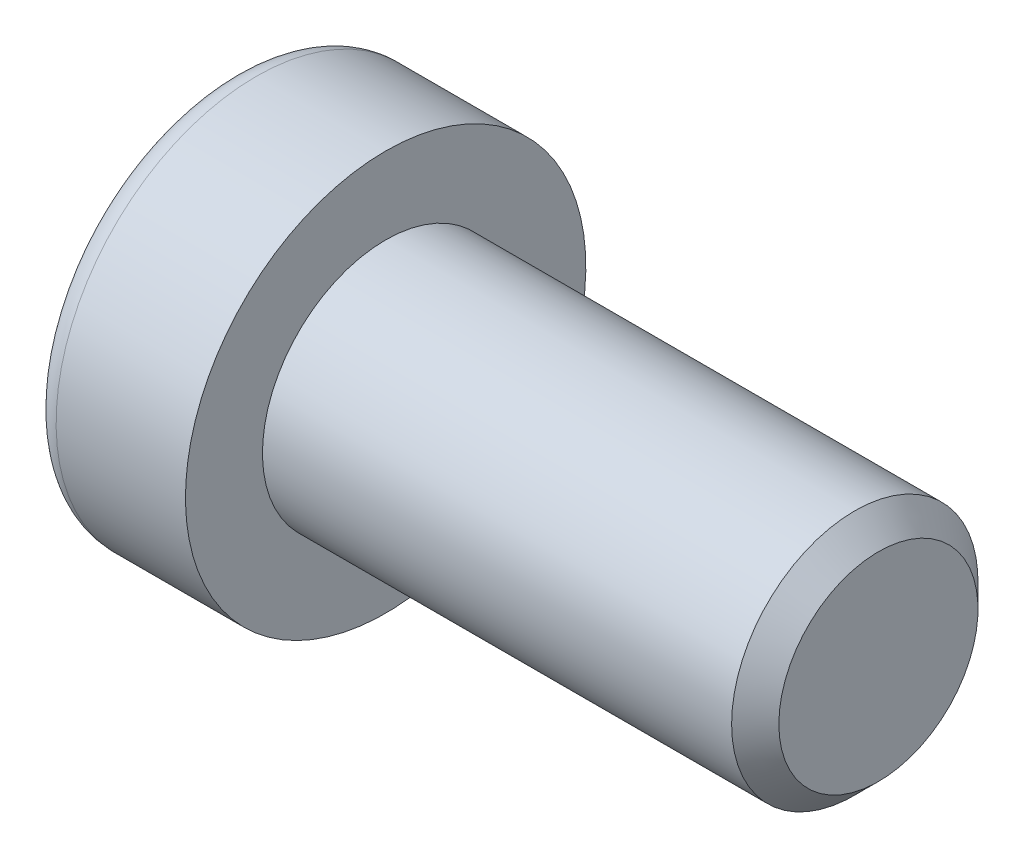
ISO-10303-21;
HEADER;
FILE_DESCRIPTION(('STEP AP214'),'2;1');
FILE_NAME('part.step','',(''),(''),'','','');
FILE_SCHEMA(('AUTOMOTIVE_DESIGN { 1 0 10303 214 1 1 1 1 }'));
ENDSEC;
DATA;
#1=APPLICATION_CONTEXT('core data for automotive mechanical design processes');
#2=APPLICATION_PROTOCOL_DEFINITION('international standard','automotive_design',2000,#1);
#3=PRODUCT_CONTEXT('',#1,'mechanical');
#4=PRODUCT('Part','Part','',(#3));
#5=PRODUCT_RELATED_PRODUCT_CATEGORY('part','',(#4));
#6=PRODUCT_DEFINITION_FORMATION('','',#4);
#7=PRODUCT_DEFINITION_CONTEXT('part definition',#1,'design');
#8=PRODUCT_DEFINITION('design','',#6,#7);
#9=PRODUCT_DEFINITION_SHAPE('','',#8);
#10=(LENGTH_UNIT() NAMED_UNIT(*) SI_UNIT(.MILLI.,.METRE.));
#11=(NAMED_UNIT(*) PLANE_ANGLE_UNIT() SI_UNIT($,.RADIAN.));
#12=(NAMED_UNIT(*) SI_UNIT($,.STERADIAN.) SOLID_ANGLE_UNIT());
#13=UNCERTAINTY_MEASURE_WITH_UNIT(LENGTH_MEASURE(1.E-05),#10,'distance_accuracy_value','');
#14=(GEOMETRIC_REPRESENTATION_CONTEXT(3) GLOBAL_UNCERTAINTY_ASSIGNED_CONTEXT((#13)) GLOBAL_UNIT_ASSIGNED_CONTEXT((#10,
#11,#12)) REPRESENTATION_CONTEXT('',''));
#15=CARTESIAN_POINT('',(0.,0.,0.));
#16=DIRECTION('',(0.,0.,1.));
#17=DIRECTION('',(1.,0.,0.));
#18=AXIS2_PLACEMENT_3D('',#15,#16,#17);
#19=CARTESIAN_POINT('',(-1.21000000177673,0.,0.));
#20=DIRECTION('',(-1.,0.,0.));
#21=DIRECTION('',(0.,0.,1.));
#22=AXIS2_PLACEMENT_3D('',#19,#20,#21);
#23=CONICAL_SURFACE('',#22,2.9040718530382,1.04719754996794);
#24=CARTESIAN_POINT('',(0.466666669012739,-1.13686837721616E-10,0.));
#25=VERTEX_POINT('',#24);
#26=VERTEX_LOOP('',#25);
#27=FACE_BOUND('',#26,.T.);
#28=CARTESIAN_POINT('',(-1.20000000188032,2.50000000042828,1.44337567243126));
#29=CARTESIAN_POINT('',(-1.16336943336427,2.50000000015382,1.31652043353318));
#30=CARTESIAN_POINT('',(-1.13005584831707,2.50000000004123,1.18857018203745));
#31=CARTESIAN_POINT('',(-1.07190798610144,2.49999999995868,0.930454306037677));
#32=CARTESIAN_POINT('',(-1.04709427719735,2.49999999998906,0.800284096806924));
#33=CARTESIAN_POINT('',(-1.00846995036617,2.50000000001067,0.541556812494233));
#34=CARTESIAN_POINT('',(-0.994402236162447,2.50000000000284,0.413039534770439));
#35=CARTESIAN_POINT('',(-0.977611461824864,2.49999999999716,0.155400578562858));
#36=CARTESIAN_POINT('',(-0.974874494142074,2.49999999999929,0.02627983588409));
#37=CARTESIAN_POINT('',(-0.980582864422355,2.50000000000062,-0.21496841995549));
#38=CARTESIAN_POINT('',(-0.987626608278002,2.50000000000017,-0.327132134383147));
#39=CARTESIAN_POINT('',(-1.00994662771906,2.49999999999983,-0.550728853222557));
#40=CARTESIAN_POINT('',(-1.02523052031715,2.49999999999995,-0.66216108485018));
#41=CARTESIAN_POINT('',(-1.06343729360609,2.50000000000005,-0.886218434015897));
#42=CARTESIAN_POINT('',(-1.08652205474861,2.50000000000003,-0.998815208377871));
#43=CARTESIAN_POINT('',(-1.13891470311393,2.49999999999998,-1.2223298619213));
#44=CARTESIAN_POINT('',(-1.16821028805135,2.49999999999995,-1.33325060237494));
#45=CARTESIAN_POINT('',(-1.20000000215881,2.5,-1.44337567242466));
#46=B_SPLINE_CURVE_WITH_KNOTS('',3,(#28,#29,#30,#31,#32,#33,#34,#35,#36,#37,#38,#39,#40,#41,#42,
#43,#44,#45),.UNSPECIFIED.,.F.,.F.,(4,2,2,2,2,2,2,2,4),(0.,0.396270014515872,0.793492271437725,
1.18088450788727,1.56780111135406,1.90463472821334,2.24178024186127,2.58640202744164,
2.93034746593166),.UNSPECIFIED.);
#47=CARTESIAN_POINT('',(-1.20000000213914,2.49999999973261,1.44337567281968));
#48=VERTEX_POINT('',#47);
#49=CARTESIAN_POINT('',(-1.20000000222827,2.5,-1.44337567266531));
#50=VERTEX_POINT('',#49);
#51=EDGE_CURVE('E18',#48,#50,#46,.T.);
#52=ORIENTED_EDGE('',*,*,#51,.T.);
#53=CARTESIAN_POINT('',(-1.20000000188032,2.49999999974406,-1.44337567361636));
#54=CARTESIAN_POINT('',(-1.16336943336427,2.39014014011794,-1.50680329282772));
#55=CARTESIAN_POINT('',(-1.13005584831707,2.27933197184574,-1.57077841847808));
#56=CARTESIAN_POINT('',(-1.07190798610144,2.05579706606859,-1.69983635640647));
#57=CARTESIAN_POINT('',(-1.04709427719735,1.94306635807401,-1.76492146104816));
#58=CARTESIAN_POINT('',(-1.00846995036617,1.71900195721787,-1.89428510322322));
#59=CARTESIAN_POINT('',(-0.994402236162447,1.60770272987993,-1.95854374207834));
#60=CARTESIAN_POINT('',(-0.977611461824864,1.38458084879682,-2.08736322017721));
#61=CARTESIAN_POINT('',(-0.974874494142074,1.27275900548255,-2.15192359151843));
#62=CARTESIAN_POINT('',(-0.980582864422354,1.06383188730746,-2.27254771943938));
#63=CARTESIAN_POINT('',(-0.987626608278001,0.966695261230055,-2.32862957665281));
#64=CARTESIAN_POINT('',(-1.00994662771905,0.773054822512112,-2.44042793607223));
#65=CARTESIAN_POINT('',(-1.02523052031715,0.676551679122258,-2.49614405188614));
#66=CARTESIAN_POINT('',(-1.06343729360609,0.482512322840196,-2.60817272646909));
#67=CARTESIAN_POINT('',(-1.08652205474861,0.385000655858529,-2.66447111365005));
#68=CARTESIAN_POINT('',(-1.13891470311393,0.191431287771819,-2.77622844042172));
#69=CARTESIAN_POINT('',(-1.16821028805135,0.09537110873237,-2.83168881064853));
#70=CARTESIAN_POINT('',(-1.20000000215881,4.75795596297873E-10,-2.88675134567343));
#71=B_SPLINE_CURVE_WITH_KNOTS('',3,(#53,#54,#55,#56,#57,#58,#59,#60,#61,#62,#63,#64,#65,#66,#67,
#68,#69,#70),.UNSPECIFIED.,.F.,.F.,(4,2,2,2,2,2,2,2,4),(0.,0.396270014515871,0.793492271437724,
1.18088450788727,1.56780111135406,1.90463472821334,2.24178024186127,2.58640202744164,
2.93034746593166),.UNSPECIFIED.);
#72=CARTESIAN_POINT('',(-1.20000000213914,0.,-2.88675134563937));
#73=VERTEX_POINT('',#72);
#74=EDGE_CURVE('E78',#50,#73,#71,.T.);
#75=ORIENTED_EDGE('',*,*,#74,.T.);
#76=CARTESIAN_POINT('',(-1.20000000188032,-6.84219601825853E-10,-2.88675134604762));
#77=CARTESIAN_POINT('',(-1.16336943336427,-0.109859860035873,-2.8233237263609));
#78=CARTESIAN_POINT('',(-1.13005584831707,-0.220668028195489,-2.75934860051552));
#79=CARTESIAN_POINT('',(-1.07190798610144,-0.444202933890087,-2.63029066244415));
#80=CARTESIAN_POINT('',(-1.04709427719735,-0.556933641915047,-2.56520555785509));
#81=CARTESIAN_POINT('',(-1.00846995036617,-0.780998042792801,-2.43584191571745));
#82=CARTESIAN_POINT('',(-0.994402236162447,-0.892297270122914,-2.37158327684878));
#83=CARTESIAN_POINT('',(-0.977611461824864,-1.11541915120034,-2.24276379874007));
#84=CARTESIAN_POINT('',(-0.974874494142074,-1.22724099451673,-2.17820342740253));
#85=CARTESIAN_POINT('',(-0.980582864422354,-1.43616811269316,-2.05757929948389));
#86=CARTESIAN_POINT('',(-0.987626608278001,-1.53330473877011,-2.00149744226967));
#87=CARTESIAN_POINT('',(-1.00994662771906,-1.72694517748772,-1.88969908284967));
#88=CARTESIAN_POINT('',(-1.02523052031715,-1.82344832087769,-1.83398296703597));
#89=CARTESIAN_POINT('',(-1.06343729360609,-2.01748767715985,-1.72195429245319));
#90=CARTESIAN_POINT('',(-1.08652205474861,-2.1149993441415,-1.66565590527218));
#91=CARTESIAN_POINT('',(-1.13891470311393,-2.30856871222816,-1.55389857850043));
#92=CARTESIAN_POINT('',(-1.16821028805135,-2.40462889126758,-1.49843820827358));
#93=CARTESIAN_POINT('',(-1.20000000215881,-2.49999999952421,-1.44337567324877));
#94=B_SPLINE_CURVE_WITH_KNOTS('',3,(#76,#77,#78,#79,#80,#81,#82,#83,#84,#85,#86,#87,#88,#89,#90,
#91,#92,#93),.UNSPECIFIED.,.F.,.F.,(4,2,2,2,2,2,2,2,4),(0.,0.396270014515872,0.793492271437725,
1.18088450788727,1.56780111135406,1.90463472821334,2.24178024186127,2.58640202744164,
2.93034746593167),.UNSPECIFIED.);
#95=CARTESIAN_POINT('',(-1.20000000213914,-2.49999999973261,-1.44337567281968));
#96=VERTEX_POINT('',#95);
#97=EDGE_CURVE('E103',#73,#96,#94,.T.);
#98=ORIENTED_EDGE('',*,*,#97,.T.);
#99=CARTESIAN_POINT('',(-1.20000000188032,-2.50000000042828,-1.44337567243126));
#100=CARTESIAN_POINT('',(-1.16336943336427,-2.50000000015382,-1.31652043353318));
#101=CARTESIAN_POINT('',(-1.13005584831707,-2.50000000004123,-1.18857018203745));
#102=CARTESIAN_POINT('',(-1.07190798610144,-2.49999999995868,-0.93045430603768));
#103=CARTESIAN_POINT('',(-1.04709427719735,-2.49999999998906,-0.800284096806928));
#104=CARTESIAN_POINT('',(-1.00846995036617,-2.50000000001067,-0.541556812494236));
#105=CARTESIAN_POINT('',(-0.994402236162447,-2.50000000000284,-0.413039534770443));
#106=CARTESIAN_POINT('',(-0.977611461824863,-2.49999999999716,-0.155400578562862));
#107=CARTESIAN_POINT('',(-0.974874494142073,-2.49999999999929,-0.0262798358840941));
#108=CARTESIAN_POINT('',(-0.980582864422354,-2.50000000000062,0.214968419955486));
#109=CARTESIAN_POINT('',(-0.987626608278001,-2.50000000000017,0.327132134383144));
#110=CARTESIAN_POINT('',(-1.00994662771905,-2.49999999999983,0.550728853222554));
#111=CARTESIAN_POINT('',(-1.02523052031715,-2.49999999999995,0.662161084850177));
#112=CARTESIAN_POINT('',(-1.06343729360609,-2.50000000000005,0.886218434015895));
#113=CARTESIAN_POINT('',(-1.08652205474861,-2.50000000000002,0.99881520837787));
#114=CARTESIAN_POINT('',(-1.13891470311393,-2.49999999999998,1.2223298619213));
#115=CARTESIAN_POINT('',(-1.16821028805135,-2.49999999999995,1.33325060237494));
#116=CARTESIAN_POINT('',(-1.20000000215881,-2.5,1.44337567242466));
#117=B_SPLINE_CURVE_WITH_KNOTS('',3,(#99,#100,#101,#102,#103,#104,#105,#106,#107,#108,#109,#110,
#111,#112,#113,#114,#115,#116),.UNSPECIFIED.,.F.,.F.,(4,2,2,2,2,2,2,2,4),(0.,0.396270014515872,
0.793492271437724,1.18088450788727,1.56780111135406,1.90463472821334,2.24178024186127,
2.58640202744164,2.93034746593167),.UNSPECIFIED.);
#118=CARTESIAN_POINT('',(-1.20000000213914,-2.49999999973261,1.44337567281969));
#119=VERTEX_POINT('',#118);
#120=EDGE_CURVE('E127',#96,#119,#117,.T.);
#121=ORIENTED_EDGE('',*,*,#120,.T.);
#122=CARTESIAN_POINT('',(-1.20000000188032,-2.49999999974406,1.44337567361636));
#123=CARTESIAN_POINT('',(-1.16336943336427,-2.39014014011795,1.50680329282772));
#124=CARTESIAN_POINT('',(-1.13005584831707,-2.27933197184574,1.57077841847807));
#125=CARTESIAN_POINT('',(-1.07190798610144,-2.05579706606859,1.69983635640647));
#126=CARTESIAN_POINT('',(-1.04709427719735,-1.94306635807401,1.76492146104816));
#127=CARTESIAN_POINT('',(-1.00846995036617,-1.71900195721787,1.89428510322322));
#128=CARTESIAN_POINT('',(-0.994402236162447,-1.60770272987993,1.95854374207834));
#129=CARTESIAN_POINT('',(-0.977611461824864,-1.38458084879682,2.08736322017721));
#130=CARTESIAN_POINT('',(-0.974874494142074,-1.27275900548255,2.15192359151843));
#131=CARTESIAN_POINT('',(-0.980582864422354,-1.06383188730746,2.27254771943938));
#132=CARTESIAN_POINT('',(-0.987626608278001,-0.966695261230056,2.32862957665281));
#133=CARTESIAN_POINT('',(-1.00994662771905,-0.773054822512113,2.44042793607223));
#134=CARTESIAN_POINT('',(-1.02523052031715,-0.676551679122259,2.49614405188614));
#135=CARTESIAN_POINT('',(-1.06343729360609,-0.482512322840196,2.60817272646909));
#136=CARTESIAN_POINT('',(-1.08652205474861,-0.385000655858529,2.66447111365005));
#137=CARTESIAN_POINT('',(-1.13891470311393,-0.19143128777182,2.77622844042172));
#138=CARTESIAN_POINT('',(-1.16821028805135,-0.0953711087323701,2.83168881064853));
#139=CARTESIAN_POINT('',(-1.20000000215881,-4.7579556411033E-10,2.88675134567343));
#140=B_SPLINE_CURVE_WITH_KNOTS('',3,(#122,#123,#124,#125,#126,#127,#128,#129,#130,#131,#132,
#133,#134,#135,#136,#137,#138,#139),.UNSPECIFIED.,.F.,.F.,(4,2,2,2,2,2,2,2,4),(0.,
0.396270014515872,0.793492271437724,1.18088450788727,1.56780111135406,1.90463472821334,
2.24178024186127,2.58640202744164,2.93034746593167),.UNSPECIFIED.);
#141=CARTESIAN_POINT('',(-1.20000000213914,0.,2.88675134563937));
#142=VERTEX_POINT('',#141);
#143=EDGE_CURVE('E135',#119,#142,#140,.T.);
#144=ORIENTED_EDGE('',*,*,#143,.T.);
#145=CARTESIAN_POINT('',(-1.20000000188032,6.84218409911555E-10,2.88675134604763));
#146=CARTESIAN_POINT('',(-1.16336943336427,0.109859860035872,2.8233237263609));
#147=CARTESIAN_POINT('',(-1.13005584831707,0.220668028195487,2.75934860051552));
#148=CARTESIAN_POINT('',(-1.07190798610144,0.444202933890086,2.63029066244415));
#149=CARTESIAN_POINT('',(-1.04709427719735,0.556933641915045,2.56520555785509));
#150=CARTESIAN_POINT('',(-1.00846995036617,0.780998042792799,2.43584191571745));
#151=CARTESIAN_POINT('',(-0.994402236162446,0.892297270122912,2.37158327684878));
#152=CARTESIAN_POINT('',(-0.977611461824863,1.11541915120034,2.24276379874007));
#153=CARTESIAN_POINT('',(-0.974874494142073,1.22724099451673,2.17820342740253));
#154=CARTESIAN_POINT('',(-0.980582864422353,1.43616811269316,2.05757929948389));
#155=CARTESIAN_POINT('',(-0.987626608278,1.53330473877011,2.00149744226967));
#156=CARTESIAN_POINT('',(-1.00994662771905,1.72694517748772,1.88969908284967));
#157=CARTESIAN_POINT('',(-1.02523052031715,1.82344832087769,1.83398296703596));
#158=CARTESIAN_POINT('',(-1.06343729360609,2.01748767715985,1.72195429245319));
#159=CARTESIAN_POINT('',(-1.08652205474861,2.1149993441415,1.66565590527218));
#160=CARTESIAN_POINT('',(-1.13891470311393,2.30856871222816,1.55389857850042));
#161=CARTESIAN_POINT('',(-1.16821028805135,2.40462889126758,1.49843820827358));
#162=CARTESIAN_POINT('',(-1.2000000021588,2.49999999952421,1.44337567324876));
#163=B_SPLINE_CURVE_WITH_KNOTS('',3,(#145,#146,#147,#148,#149,#150,#151,#152,#153,#154,#155,
#156,#157,#158,#159,#160,#161,#162),.UNSPECIFIED.,.F.,.F.,(4,2,2,2,2,2,2,2,4),(0.,
0.396270014515872,0.793492271437725,1.18088450788727,1.56780111135406,1.90463472821334,
2.24178024186127,2.58640202744164,2.93034746593167),.UNSPECIFIED.);
#164=EDGE_CURVE('E80',#142,#48,#163,.T.);
#165=ORIENTED_EDGE('',*,*,#164,.T.);
#166=EDGE_LOOP('',(#52,#75,#98,#121,#144,#165));
#167=FACE_BOUND('',#166,.T.);
#168=ADVANCED_FACE('F14',(#27,#167),#23,.F.);
#169=CARTESIAN_POINT('',(-5.,2.5,1.44337567297406));
#170=DIRECTION('',(0.,1.,0.));
#171=DIRECTION('',(0.,0.,1.));
#172=AXIS2_PLACEMENT_3D('',#169,#170,#171);
#173=PLANE('',#172);
#174=DIRECTION('',(1.,0.,0.));
#175=VECTOR('',#174,1.);
#176=CARTESIAN_POINT('',(-5.,2.5,1.44337567297406));
#177=LINE('',#176,#175);
#178=CARTESIAN_POINT('',(-5.,2.5,1.44337567297406));
#179=VERTEX_POINT('',#178);
#180=EDGE_CURVE('E82',#48,#179,#177,.F.);
#181=ORIENTED_EDGE('',*,*,#180,.T.);
#182=DIRECTION('',(0.,0.,1.));
#183=VECTOR('',#182,1.);
#184=CARTESIAN_POINT('',(-5.,2.5,0.));
#185=LINE('',#184,#183);
#186=CARTESIAN_POINT('',(-5.,2.5,-1.44337567297407));
#187=VERTEX_POINT('',#186);
#188=EDGE_CURVE('E87',#187,#179,#185,.T.);
#189=ORIENTED_EDGE('',*,*,#188,.F.);
#190=DIRECTION('',(1.,0.,0.));
#191=VECTOR('',#190,1.);
#192=CARTESIAN_POINT('',(-5.,2.5,-1.44337567297407));
#193=LINE('',#192,#191);
#194=EDGE_CURVE('E85',#187,#50,#193,.T.);
#195=ORIENTED_EDGE('',*,*,#194,.T.);
#196=ORIENTED_EDGE('',*,*,#51,.F.);
#197=EDGE_LOOP('',(#181,#189,#195,#196));
#198=FACE_BOUND('',#197,.T.);
#199=ADVANCED_FACE('F74',(#198),#173,.F.);
#200=CARTESIAN_POINT('',(-5.,0.,2.88675134594813));
#201=DIRECTION('',(0.,0.500000000000001,0.866025403784438));
#202=DIRECTION('',(0.,-0.866025403784438,0.500000000000001));
#203=AXIS2_PLACEMENT_3D('',#200,#201,#202);
#204=PLANE('',#203);
#205=DIRECTION('',(1.,0.,0.));
#206=VECTOR('',#205,1.);
#207=CARTESIAN_POINT('',(-5.,0.,2.88675134594813));
#208=LINE('',#207,#206);
#209=CARTESIAN_POINT('',(-5.,0.,2.88675134594813));
#210=VERTEX_POINT('',#209);
#211=EDGE_CURVE('E139',#142,#210,#208,.F.);
#212=ORIENTED_EDGE('',*,*,#211,.T.);
#213=DIRECTION('',(0.,-0.866025403784438,0.500000000000001));
#214=VECTOR('',#213,1.);
#215=CARTESIAN_POINT('',(-5.,2.5,1.44337567297406));
#216=LINE('',#215,#214);
#217=EDGE_CURVE('E93',#179,#210,#216,.T.);
#218=ORIENTED_EDGE('',*,*,#217,.F.);
#219=ORIENTED_EDGE('',*,*,#180,.F.);
#220=ORIENTED_EDGE('',*,*,#164,.F.);
#221=EDGE_LOOP('',(#212,#218,#219,#220));
#222=FACE_BOUND('',#221,.T.);
#223=ADVANCED_FACE('F143',(#222),#204,.F.);
#224=CARTESIAN_POINT('',(-5.,-2.5,1.44337567297406));
#225=DIRECTION('',(0.,-0.5,0.866025403784439));
#226=DIRECTION('',(0.,-0.866025403784439,-0.5));
#227=AXIS2_PLACEMENT_3D('',#224,#225,#226);
#228=PLANE('',#227);
#229=DIRECTION('',(1.,0.,0.));
#230=VECTOR('',#229,1.);
#231=CARTESIAN_POINT('',(-5.,-2.5,1.44337567297406));
#232=LINE('',#231,#230);
#233=CARTESIAN_POINT('',(-5.,-2.5,1.44337567297406));
#234=VERTEX_POINT('',#233);
#235=EDGE_CURVE('E134',#119,#234,#232,.F.);
#236=ORIENTED_EDGE('',*,*,#235,.T.);
#237=DIRECTION('',(0.,-0.866025403784439,-0.5));
#238=VECTOR('',#237,1.);
#239=CARTESIAN_POINT('',(-5.,0.,2.88675134594813));
#240=LINE('',#239,#238);
#241=EDGE_CURVE('E222',#210,#234,#240,.T.);
#242=ORIENTED_EDGE('',*,*,#241,.F.);
#243=ORIENTED_EDGE('',*,*,#211,.F.);
#244=ORIENTED_EDGE('',*,*,#143,.F.);
#245=EDGE_LOOP('',(#236,#242,#243,#244));
#246=FACE_BOUND('',#245,.T.);
#247=ADVANCED_FACE('F123',(#246),#228,.F.);
#248=CARTESIAN_POINT('',(-5.,-2.5,-1.44337567297406));
#249=DIRECTION('',(0.,-1.,0.));
#250=DIRECTION('',(0.,0.,-1.));
#251=AXIS2_PLACEMENT_3D('',#248,#249,#250);
#252=PLANE('',#251);
#253=DIRECTION('',(1.,0.,0.));
#254=VECTOR('',#253,1.);
#255=CARTESIAN_POINT('',(-5.,-2.5,-1.44337567297406));
#256=LINE('',#255,#254);
#257=CARTESIAN_POINT('',(-5.,-2.5,-1.44337567297406));
#258=VERTEX_POINT('',#257);
#259=EDGE_CURVE('E133',#96,#258,#256,.F.);
#260=ORIENTED_EDGE('',*,*,#259,.T.);
#261=DIRECTION('',(0.,0.,1.));
#262=VECTOR('',#261,1.);
#263=CARTESIAN_POINT('',(-5.,-2.5,0.));
#264=LINE('',#263,#262);
#265=EDGE_CURVE('E219',#234,#258,#264,.F.);
#266=ORIENTED_EDGE('',*,*,#265,.F.);
#267=ORIENTED_EDGE('',*,*,#235,.F.);
#268=ORIENTED_EDGE('',*,*,#120,.F.);
#269=EDGE_LOOP('',(#260,#266,#267,#268));
#270=FACE_BOUND('',#269,.T.);
#271=ADVANCED_FACE('F119',(#270),#252,.F.);
#272=CARTESIAN_POINT('',(-5.,0.,-2.88675134594813));
#273=DIRECTION('',(0.,-0.5,-0.866025403784439));
#274=DIRECTION('',(0.,0.866025403784439,-0.5));
#275=AXIS2_PLACEMENT_3D('',#272,#273,#274);
#276=PLANE('',#275);
#277=DIRECTION('',(1.,0.,0.));
#278=VECTOR('',#277,1.);
#279=CARTESIAN_POINT('',(-5.,0.,-2.88675134594813));
#280=LINE('',#279,#278);
#281=CARTESIAN_POINT('',(-5.,0.,-2.88675134594813));
#282=VERTEX_POINT('',#281);
#283=EDGE_CURVE('E36',#73,#282,#280,.F.);
#284=ORIENTED_EDGE('',*,*,#283,.T.);
#285=DIRECTION('',(0.,0.866025403784438,-0.500000000000001));
#286=VECTOR('',#285,1.);
#287=CARTESIAN_POINT('',(-5.,-2.5,-1.44337567297406));
#288=LINE('',#287,#286);
#289=EDGE_CURVE('E216',#258,#282,#288,.T.);
#290=ORIENTED_EDGE('',*,*,#289,.F.);
#291=ORIENTED_EDGE('',*,*,#259,.F.);
#292=ORIENTED_EDGE('',*,*,#97,.F.);
#293=EDGE_LOOP('',(#284,#290,#291,#292));
#294=FACE_BOUND('',#293,.T.);
#295=ADVANCED_FACE('F113',(#294),#276,.F.);
#296=CARTESIAN_POINT('',(-5.,2.5,-1.44337567297407));
#297=DIRECTION('',(0.,0.5,-0.866025403784439));
#298=DIRECTION('',(0.,0.866025403784439,0.5));
#299=AXIS2_PLACEMENT_3D('',#296,#297,#298);
#300=PLANE('',#299);
#301=ORIENTED_EDGE('',*,*,#194,.F.);
#302=DIRECTION('',(0.,0.866025403784439,0.5));
#303=VECTOR('',#302,1.);
#304=CARTESIAN_POINT('',(-5.,0.,-2.88675134594813));
#305=LINE('',#304,#303);
#306=EDGE_CURVE('E214',#282,#187,#305,.T.);
#307=ORIENTED_EDGE('',*,*,#306,.F.);
#308=ORIENTED_EDGE('',*,*,#283,.F.);
#309=ORIENTED_EDGE('',*,*,#74,.F.);
#310=EDGE_LOOP('',(#301,#307,#308,#309));
#311=FACE_BOUND('',#310,.T.);
#312=ADVANCED_FACE('F91',(#311),#300,.F.);
#313=CARTESIAN_POINT('',(-5.,4.69337567297407,0.));
#314=DIRECTION('',(-1.,0.,0.));
#315=DIRECTION('',(0.,0.,1.));
#316=AXIS2_PLACEMENT_3D('',#313,#314,#315);
#317=PLANE('',#316);
#318=ORIENTED_EDGE('',*,*,#289,.T.);
#319=ORIENTED_EDGE('',*,*,#306,.T.);
#320=ORIENTED_EDGE('',*,*,#188,.T.);
#321=ORIENTED_EDGE('',*,*,#217,.T.);
#322=ORIENTED_EDGE('',*,*,#241,.T.);
#323=ORIENTED_EDGE('',*,*,#265,.T.);
#324=EDGE_LOOP('',(#318,#319,#320,#321,#322,#323));
#325=FACE_BOUND('',#324,.T.);
#326=CARTESIAN_POINT('',(-5.,0.,0.));
#327=DIRECTION('',(1.,0.,0.));
#328=DIRECTION('',(0.,1.,0.));
#329=AXIS2_PLACEMENT_3D('',#326,#327,#328);
#330=CIRCLE('',#329,5.7);
#331=CARTESIAN_POINT('',(-5.,5.7,0.));
#332=VERTEX_POINT('',#331);
#333=EDGE_CURVE('E191',#332,#332,#330,.T.);
#334=ORIENTED_EDGE('',*,*,#333,.F.);
#335=EDGE_LOOP('',(#334));
#336=FACE_BOUND('',#335,.T.);
#337=ADVANCED_FACE('F112',(#325,#336),#317,.T.);
#338=CARTESIAN_POINT('',(-4.2,0.,0.));
#339=DIRECTION('',(1.,0.,0.));
#340=DIRECTION('',(0.,0.,-1.));
#341=AXIS2_PLACEMENT_3D('',#338,#339,#340);
#342=TOROIDAL_SURFACE('',#341,5.7,0.8);
#343=CARTESIAN_POINT('',(-4.2,0.,0.));
#344=DIRECTION('',(1.,0.,0.));
#345=DIRECTION('',(0.,1.,0.));
#346=AXIS2_PLACEMENT_3D('',#343,#344,#345);
#347=CIRCLE('',#346,6.5);
#348=CARTESIAN_POINT('',(-4.2,6.5,0.));
#349=VERTEX_POINT('',#348);
#350=EDGE_CURVE('E232',#349,#349,#347,.T.);
#351=ORIENTED_EDGE('',*,*,#350,.F.);
#352=EDGE_LOOP('',(#351));
#353=FACE_BOUND('',#352,.T.);
#354=ORIENTED_EDGE('',*,*,#333,.T.);
#355=EDGE_LOOP('',(#354));
#356=FACE_BOUND('',#355,.T.);
#357=ADVANCED_FACE('F175',(#353,#356),#342,.T.);
#358=CARTESIAN_POINT('',(-2.5,0.,0.));
#359=DIRECTION('',(1.,0.,0.));
#360=DIRECTION('',(0.,1.,0.));
#361=AXIS2_PLACEMENT_3D('',#358,#359,#360);
#362=CYLINDRICAL_SURFACE('',#361,6.5);
#363=ORIENTED_EDGE('',*,*,#350,.T.);
#364=EDGE_LOOP('',(#363));
#365=FACE_BOUND('',#364,.T.);
#366=CARTESIAN_POINT('',(0.,0.,0.));
#367=DIRECTION('',(1.,0.,0.));
#368=DIRECTION('',(0.,1.,0.));
#369=AXIS2_PLACEMENT_3D('',#366,#367,#368);
#370=CIRCLE('',#369,6.5);
#371=CARTESIAN_POINT('',(0.,6.5,0.));
#372=VERTEX_POINT('',#371);
#373=EDGE_CURVE('E101',#372,#372,#370,.T.);
#374=ORIENTED_EDGE('',*,*,#373,.F.);
#375=EDGE_LOOP('',(#374));
#376=FACE_BOUND('',#375,.T.);
#377=ADVANCED_FACE('F172',(#365,#376),#362,.T.);
#378=CARTESIAN_POINT('',(16.,2.,0.));
#379=DIRECTION('',(1.,0.,0.));
#380=DIRECTION('',(0.,0.,-1.));
#381=AXIS2_PLACEMENT_3D('',#378,#379,#380);
#382=PLANE('',#381);
#383=CARTESIAN_POINT('',(16.0000000003038,0.,0.));
#384=DIRECTION('',(-1.,0.,0.));
#385=DIRECTION('',(0.,0.,1.));
#386=AXIS2_PLACEMENT_3D('',#383,#384,#385);
#387=CIRCLE('',#386,3.2331875003706);
#388=CARTESIAN_POINT('',(16.0000000003038,0.,3.2331875003706));
#389=VERTEX_POINT('',#388);
#390=EDGE_CURVE('E228',#389,#389,#387,.T.);
#391=ORIENTED_EDGE('',*,*,#390,.F.);
#392=EDGE_LOOP('',(#391));
#393=FACE_BOUND('',#392,.T.);
#394=ADVANCED_FACE('F168',(#393),#382,.T.);
#395=CARTESIAN_POINT('',(0.,5.25,0.));
#396=DIRECTION('',(1.,0.,0.));
#397=DIRECTION('',(0.,0.,-1.));
#398=AXIS2_PLACEMENT_3D('',#395,#396,#397);
#399=PLANE('',#398);
#400=CARTESIAN_POINT('',(0.,0.,0.));
#401=DIRECTION('',(1.,0.,0.));
#402=DIRECTION('',(0.,1.,0.));
#403=AXIS2_PLACEMENT_3D('',#400,#401,#402);
#404=CIRCLE('',#403,4.);
#405=CARTESIAN_POINT('',(0.,4.,0.));
#406=VERTEX_POINT('',#405);
#407=EDGE_CURVE('E27',#406,#406,#404,.T.);
#408=ORIENTED_EDGE('',*,*,#407,.F.);
#409=EDGE_LOOP('',(#408));
#410=FACE_BOUND('',#409,.T.);
#411=ORIENTED_EDGE('',*,*,#373,.T.);
#412=EDGE_LOOP('',(#411));
#413=FACE_BOUND('',#412,.T.);
#414=ADVANCED_FACE('F161',(#410,#413),#399,.T.);
#415=CARTESIAN_POINT('',(15.2331874996321,0.,0.));
#416=DIRECTION('',(-1.,0.,0.));
#417=DIRECTION('',(0.,0.,1.));
#418=AXIS2_PLACEMENT_3D('',#415,#416,#417);
#419=CONICAL_SURFACE('',#418,3.99999999967804,0.785398162507894);
#420=ORIENTED_EDGE('',*,*,#390,.T.);
#421=EDGE_LOOP('',(#420));
#422=FACE_BOUND('',#421,.T.);
#423=CARTESIAN_POINT('',(15.2331875,0.,0.));
#424=DIRECTION('',(1.,0.,0.));
#425=DIRECTION('',(0.,1.,0.));
#426=AXIS2_PLACEMENT_3D('',#423,#424,#425);
#427=CIRCLE('',#426,4.);
#428=CARTESIAN_POINT('',(15.2331875,4.,0.));
#429=VERTEX_POINT('',#428);
#430=EDGE_CURVE('E9',#429,#429,#427,.F.);
#431=ORIENTED_EDGE('',*,*,#430,.F.);
#432=EDGE_LOOP('',(#431));
#433=FACE_BOUND('',#432,.T.);
#434=ADVANCED_FACE('F154',(#422,#433),#419,.T.);
#435=CARTESIAN_POINT('',(9.875,0.,0.));
#436=DIRECTION('',(1.,0.,0.));
#437=DIRECTION('',(0.,1.,0.));
#438=AXIS2_PLACEMENT_3D('',#435,#436,#437);
#439=CYLINDRICAL_SURFACE('',#438,4.);
#440=ORIENTED_EDGE('',*,*,#430,.T.);
#441=EDGE_LOOP('',(#440));
#442=FACE_BOUND('',#441,.T.);
#443=ORIENTED_EDGE('',*,*,#407,.T.);
#444=EDGE_LOOP('',(#443));
#445=FACE_BOUND('',#444,.T.);
#446=ADVANCED_FACE('F152',(#442,#445),#439,.T.);
#447=CLOSED_SHELL('',(#168,#199,#223,#247,#271,#295,#312,#337,#357,#377,#394,#414,#434,#446));
#448=MANIFOLD_SOLID_BREP('B1',#447);
#449=ADVANCED_BREP_SHAPE_REPRESENTATION('',(#18,#448),#14);
#450=SHAPE_DEFINITION_REPRESENTATION(#9,#449);
ENDSEC;
END-ISO-10303-21;
